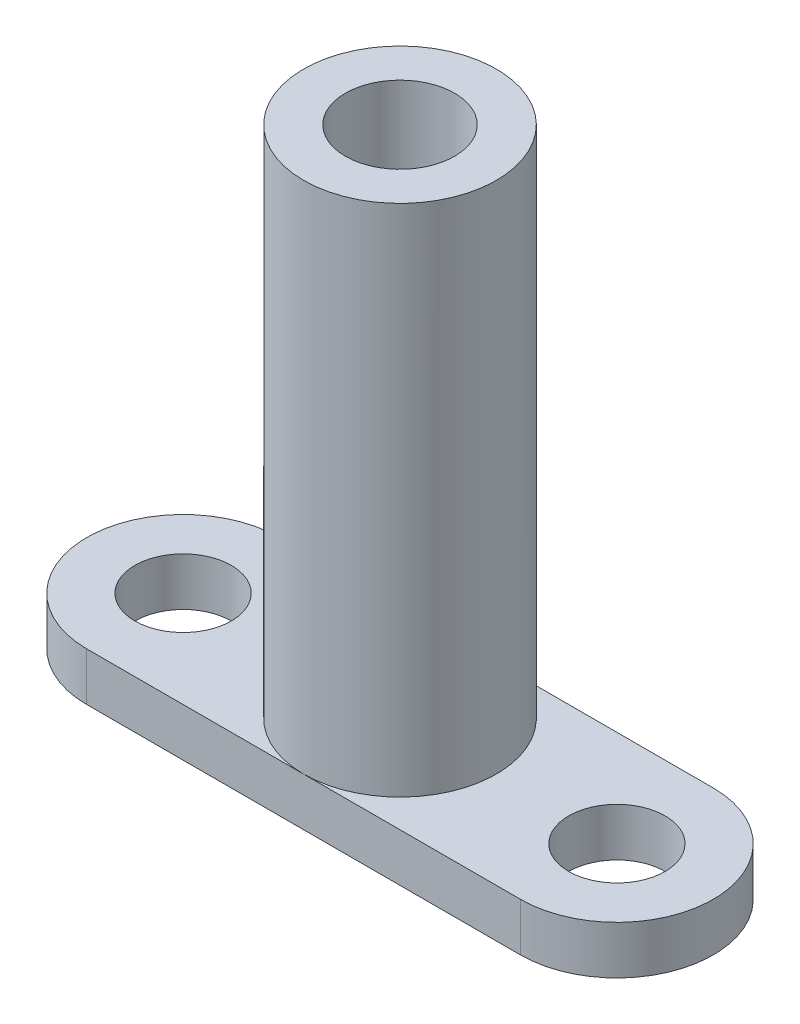
ISO-10303-21;
HEADER;
FILE_DESCRIPTION(('STEP AP214'),'2;1');
FILE_NAME('part.step','',(''),(''),'','','');
FILE_SCHEMA(('AUTOMOTIVE_DESIGN { 1 0 10303 214 1 1 1 1 }'));
ENDSEC;
DATA;
#1=APPLICATION_CONTEXT('core data for automotive mechanical design processes');
#2=APPLICATION_PROTOCOL_DEFINITION('international standard','automotive_design',2000,#1);
#3=PRODUCT_CONTEXT('',#1,'mechanical');
#4=PRODUCT('Part','Part','',(#3));
#5=PRODUCT_RELATED_PRODUCT_CATEGORY('part','',(#4));
#6=PRODUCT_DEFINITION_FORMATION('','',#4);
#7=PRODUCT_DEFINITION_CONTEXT('part definition',#1,'design');
#8=PRODUCT_DEFINITION('design','',#6,#7);
#9=PRODUCT_DEFINITION_SHAPE('','',#8);
#10=(LENGTH_UNIT() NAMED_UNIT(*) SI_UNIT(.MILLI.,.METRE.));
#11=(NAMED_UNIT(*) PLANE_ANGLE_UNIT() SI_UNIT($,.RADIAN.));
#12=(NAMED_UNIT(*) SI_UNIT($,.STERADIAN.) SOLID_ANGLE_UNIT());
#13=UNCERTAINTY_MEASURE_WITH_UNIT(LENGTH_MEASURE(1.E-05),#10,'distance_accuracy_value','');
#14=(GEOMETRIC_REPRESENTATION_CONTEXT(3) GLOBAL_UNCERTAINTY_ASSIGNED_CONTEXT((#13)) GLOBAL_UNIT_ASSIGNED_CONTEXT((#10,
#11,#12)) REPRESENTATION_CONTEXT('',''));
#15=CARTESIAN_POINT('',(0.,0.,0.));
#16=DIRECTION('',(0.,0.,1.));
#17=DIRECTION('',(1.,0.,0.));
#18=AXIS2_PLACEMENT_3D('',#15,#16,#17);
#19=CARTESIAN_POINT('',(0.,3.,0.));
#20=DIRECTION('',(0.,1.,0.));
#21=DIRECTION('',(0.,0.,1.));
#22=AXIS2_PLACEMENT_3D('',#19,#20,#21);
#23=PLANE('',#22);
#24=CARTESIAN_POINT('',(13.5,3.,0.));
#25=DIRECTION('',(0.,1.,0.));
#26=DIRECTION('',(0.,0.,1.));
#27=AXIS2_PLACEMENT_3D('',#24,#25,#26);
#28=CIRCLE('',#27,3.);
#29=CARTESIAN_POINT('',(13.5,3.,3.));
#30=VERTEX_POINT('',#29);
#31=EDGE_CURVE('E149',#30,#30,#28,.T.);
#32=ORIENTED_EDGE('',*,*,#31,.F.);
#33=EDGE_LOOP('',(#32));
#34=FACE_BOUND('',#33,.T.);
#35=CARTESIAN_POINT('',(0.,3.,0.));
#36=DIRECTION('',(0.,1.,0.));
#37=DIRECTION('',(0.,0.,1.));
#38=AXIS2_PLACEMENT_3D('',#35,#36,#37);
#39=CIRCLE('',#38,6.);
#40=CARTESIAN_POINT('',(0.,3.,6.));
#41=VERTEX_POINT('',#40);
#42=CARTESIAN_POINT('',(0.,3.,-6.));
#43=VERTEX_POINT('',#42);
#44=EDGE_CURVE('E50',#41,#43,#39,.T.);
#45=ORIENTED_EDGE('',*,*,#44,.F.);
#46=DIRECTION('',(1.,0.,0.));
#47=VECTOR('',#46,1.);
#48=CARTESIAN_POINT('',(0.,3.,6.));
#49=LINE('',#48,#47);
#50=CARTESIAN_POINT('',(13.5,3.,6.));
#51=VERTEX_POINT('',#50);
#52=EDGE_CURVE('E98',#41,#51,#49,.T.);
#53=ORIENTED_EDGE('',*,*,#52,.T.);
#54=CARTESIAN_POINT('',(13.5,3.,0.));
#55=DIRECTION('',(0.,1.,0.));
#56=DIRECTION('',(0.,0.,1.));
#57=AXIS2_PLACEMENT_3D('',#54,#55,#56);
#58=CIRCLE('',#57,6.);
#59=CARTESIAN_POINT('',(13.5,3.,-6.));
#60=VERTEX_POINT('',#59);
#61=EDGE_CURVE('E97',#51,#60,#58,.T.);
#62=ORIENTED_EDGE('',*,*,#61,.T.);
#63=DIRECTION('',(1.,0.,0.));
#64=VECTOR('',#63,1.);
#65=CARTESIAN_POINT('',(0.,3.,-6.));
#66=LINE('',#65,#64);
#67=EDGE_CURVE('E109',#43,#60,#66,.T.);
#68=ORIENTED_EDGE('',*,*,#67,.F.);
#69=EDGE_LOOP('',(#45,#53,#62,#68));
#70=FACE_BOUND('',#69,.T.);
#71=ADVANCED_FACE('F39',(#34,#70),#23,.T.);
#72=CARTESIAN_POINT('',(-13.5,3.,0.));
#73=DIRECTION('',(0.,-1.,0.));
#74=DIRECTION('',(0.,0.,-1.));
#75=AXIS2_PLACEMENT_3D('',#72,#73,#74);
#76=CYLINDRICAL_SURFACE('',#75,6.);
#77=CARTESIAN_POINT('',(-13.5,0.,0.));
#78=DIRECTION('',(0.,1.,0.));
#79=DIRECTION('',(0.,0.,1.));
#80=AXIS2_PLACEMENT_3D('',#77,#78,#79);
#81=CIRCLE('',#80,6.);
#82=CARTESIAN_POINT('',(-13.5,0.,-6.));
#83=VERTEX_POINT('',#82);
#84=CARTESIAN_POINT('',(-13.5,0.,6.));
#85=VERTEX_POINT('',#84);
#86=EDGE_CURVE('E161',#83,#85,#81,.T.);
#87=ORIENTED_EDGE('',*,*,#86,.T.);
#88=DIRECTION('',(0.,-1.,0.));
#89=VECTOR('',#88,1.);
#90=CARTESIAN_POINT('',(-13.5,3.,6.));
#91=LINE('',#90,#89);
#92=CARTESIAN_POINT('',(-13.5,3.,6.));
#93=VERTEX_POINT('',#92);
#94=EDGE_CURVE('E48',#93,#85,#91,.T.);
#95=ORIENTED_EDGE('',*,*,#94,.F.);
#96=CARTESIAN_POINT('',(-13.5,3.,0.));
#97=DIRECTION('',(0.,1.,0.));
#98=DIRECTION('',(0.,0.,1.));
#99=AXIS2_PLACEMENT_3D('',#96,#97,#98);
#100=CIRCLE('',#99,6.);
#101=CARTESIAN_POINT('',(-13.5,3.,-6.));
#102=VERTEX_POINT('',#101);
#103=EDGE_CURVE('E95',#102,#93,#100,.T.);
#104=ORIENTED_EDGE('',*,*,#103,.F.);
#105=DIRECTION('',(0.,-1.,0.));
#106=VECTOR('',#105,1.);
#107=CARTESIAN_POINT('',(-13.5,3.,-6.));
#108=LINE('',#107,#106);
#109=EDGE_CURVE('E64',#102,#83,#108,.T.);
#110=ORIENTED_EDGE('',*,*,#109,.T.);
#111=EDGE_LOOP('',(#87,#95,#104,#110));
#112=FACE_BOUND('',#111,.T.);
#113=ADVANCED_FACE('F41',(#112),#76,.T.);
#114=CARTESIAN_POINT('',(0.,3.,6.));
#115=DIRECTION('',(0.,0.,-1.));
#116=DIRECTION('',(-1.,0.,0.));
#117=AXIS2_PLACEMENT_3D('',#114,#115,#116);
#118=PLANE('',#117);
#119=DIRECTION('',(1.,0.,0.));
#120=VECTOR('',#119,1.);
#121=CARTESIAN_POINT('',(0.,0.,6.));
#122=LINE('',#121,#120);
#123=CARTESIAN_POINT('',(13.5,0.,6.));
#124=VERTEX_POINT('',#123);
#125=EDGE_CURVE('E169',#85,#124,#122,.T.);
#126=ORIENTED_EDGE('',*,*,#125,.T.);
#127=DIRECTION('',(0.,-1.,0.));
#128=VECTOR('',#127,1.);
#129=CARTESIAN_POINT('',(13.5,3.,6.));
#130=LINE('',#129,#128);
#131=EDGE_CURVE('E104',#51,#124,#130,.T.);
#132=ORIENTED_EDGE('',*,*,#131,.F.);
#133=ORIENTED_EDGE('',*,*,#52,.F.);
#134=EDGE_CURVE('E90',#93,#41,#49,.T.);
#135=ORIENTED_EDGE('',*,*,#134,.F.);
#136=ORIENTED_EDGE('',*,*,#94,.T.);
#137=EDGE_LOOP('',(#126,#132,#133,#135,#136));
#138=FACE_BOUND('',#137,.T.);
#139=ADVANCED_FACE('F102',(#138),#118,.F.);
#140=CARTESIAN_POINT('',(13.5,3.,0.));
#141=DIRECTION('',(0.,-1.,0.));
#142=DIRECTION('',(0.,0.,-1.));
#143=AXIS2_PLACEMENT_3D('',#140,#141,#142);
#144=CYLINDRICAL_SURFACE('',#143,6.);
#145=CARTESIAN_POINT('',(13.5,0.,0.));
#146=DIRECTION('',(0.,1.,0.));
#147=DIRECTION('',(0.,0.,1.));
#148=AXIS2_PLACEMENT_3D('',#145,#146,#147);
#149=CIRCLE('',#148,6.);
#150=CARTESIAN_POINT('',(13.5,0.,-6.));
#151=VERTEX_POINT('',#150);
#152=EDGE_CURVE('E171',#124,#151,#149,.T.);
#153=ORIENTED_EDGE('',*,*,#152,.T.);
#154=DIRECTION('',(0.,-1.,0.));
#155=VECTOR('',#154,1.);
#156=CARTESIAN_POINT('',(13.5,3.,-6.));
#157=LINE('',#156,#155);
#158=EDGE_CURVE('E177',#60,#151,#157,.T.);
#159=ORIENTED_EDGE('',*,*,#158,.F.);
#160=ORIENTED_EDGE('',*,*,#61,.F.);
#161=ORIENTED_EDGE('',*,*,#131,.T.);
#162=EDGE_LOOP('',(#153,#159,#160,#161));
#163=FACE_BOUND('',#162,.T.);
#164=ADVANCED_FACE('F142',(#163),#144,.T.);
#165=CARTESIAN_POINT('',(0.,3.,-6.));
#166=DIRECTION('',(0.,0.,-1.));
#167=DIRECTION('',(-1.,0.,0.));
#168=AXIS2_PLACEMENT_3D('',#165,#166,#167);
#169=PLANE('',#168);
#170=DIRECTION('',(1.,0.,0.));
#171=VECTOR('',#170,1.);
#172=CARTESIAN_POINT('',(0.,0.,-6.));
#173=LINE('',#172,#171);
#174=EDGE_CURVE('E163',#83,#151,#173,.T.);
#175=ORIENTED_EDGE('',*,*,#174,.F.);
#176=ORIENTED_EDGE('',*,*,#109,.F.);
#177=EDGE_CURVE('E166',#102,#43,#66,.T.);
#178=ORIENTED_EDGE('',*,*,#177,.T.);
#179=ORIENTED_EDGE('',*,*,#67,.T.);
#180=ORIENTED_EDGE('',*,*,#158,.T.);
#181=EDGE_LOOP('',(#175,#176,#178,#179,#180));
#182=FACE_BOUND('',#181,.T.);
#183=ADVANCED_FACE('F137',(#182),#169,.T.);
#184=CARTESIAN_POINT('',(-13.5,3.,0.));
#185=DIRECTION('',(0.,1.,0.));
#186=DIRECTION('',(0.,0.,1.));
#187=AXIS2_PLACEMENT_3D('',#184,#185,#186);
#188=CIRCLE('',#187,3.);
#189=CARTESIAN_POINT('',(-13.5,3.,3.));
#190=VERTEX_POINT('',#189);
#191=EDGE_CURVE('E146',#190,#190,#188,.T.);
#192=ORIENTED_EDGE('',*,*,#191,.F.);
#193=EDGE_LOOP('',(#192));
#194=FACE_BOUND('',#193,.T.);
#195=EDGE_CURVE('E11',#43,#41,#39,.T.);
#196=ORIENTED_EDGE('',*,*,#195,.F.);
#197=ORIENTED_EDGE('',*,*,#177,.F.);
#198=ORIENTED_EDGE('',*,*,#103,.T.);
#199=ORIENTED_EDGE('',*,*,#134,.T.);
#200=EDGE_LOOP('',(#196,#197,#198,#199));
#201=FACE_BOUND('',#200,.T.);
#202=ADVANCED_FACE('F94',(#194,#201),#23,.T.);
#203=CARTESIAN_POINT('',(0.,0.,0.));
#204=DIRECTION('',(0.,1.,0.));
#205=DIRECTION('',(0.,0.,1.));
#206=AXIS2_PLACEMENT_3D('',#203,#204,#205);
#207=PLANE('',#206);
#208=CARTESIAN_POINT('',(-13.5,0.,0.));
#209=DIRECTION('',(0.,1.,0.));
#210=DIRECTION('',(0.,0.,1.));
#211=AXIS2_PLACEMENT_3D('',#208,#209,#210);
#212=CIRCLE('',#211,3.);
#213=CARTESIAN_POINT('',(-13.5,0.,3.));
#214=VERTEX_POINT('',#213);
#215=EDGE_CURVE('E43',#214,#214,#212,.T.);
#216=ORIENTED_EDGE('',*,*,#215,.T.);
#217=EDGE_LOOP('',(#216));
#218=FACE_BOUND('',#217,.T.);
#219=CARTESIAN_POINT('',(13.5,0.,0.));
#220=DIRECTION('',(0.,1.,0.));
#221=DIRECTION('',(0.,0.,1.));
#222=AXIS2_PLACEMENT_3D('',#219,#220,#221);
#223=CIRCLE('',#222,3.);
#224=CARTESIAN_POINT('',(13.5,0.,3.));
#225=VERTEX_POINT('',#224);
#226=EDGE_CURVE('E148',#225,#225,#223,.T.);
#227=ORIENTED_EDGE('',*,*,#226,.T.);
#228=EDGE_LOOP('',(#227));
#229=FACE_BOUND('',#228,.T.);
#230=CARTESIAN_POINT('',(0.,0.,0.));
#231=DIRECTION('',(0.,1.,0.));
#232=DIRECTION('',(0.,0.,1.));
#233=AXIS2_PLACEMENT_3D('',#230,#231,#232);
#234=CIRCLE('',#233,3.39999999999999);
#235=CARTESIAN_POINT('',(0.,0.,3.39999999999999));
#236=VERTEX_POINT('',#235);
#237=EDGE_CURVE('E112',#236,#236,#234,.T.);
#238=ORIENTED_EDGE('',*,*,#237,.T.);
#239=EDGE_LOOP('',(#238));
#240=FACE_BOUND('',#239,.T.);
#241=ORIENTED_EDGE('',*,*,#86,.F.);
#242=ORIENTED_EDGE('',*,*,#174,.T.);
#243=ORIENTED_EDGE('',*,*,#152,.F.);
#244=ORIENTED_EDGE('',*,*,#125,.F.);
#245=EDGE_LOOP('',(#241,#242,#243,#244));
#246=FACE_BOUND('',#245,.T.);
#247=ADVANCED_FACE('F116',(#218,#229,#240,#246),#207,.F.);
#248=CARTESIAN_POINT('',(0.,35.,0.));
#249=DIRECTION('',(0.,-1.,0.));
#250=DIRECTION('',(0.,0.,-1.));
#251=AXIS2_PLACEMENT_3D('',#248,#249,#250);
#252=CYLINDRICAL_SURFACE('',#251,6.);
#253=CARTESIAN_POINT('',(0.,35.,0.));
#254=DIRECTION('',(0.,1.,0.));
#255=DIRECTION('',(0.,0.,1.));
#256=AXIS2_PLACEMENT_3D('',#253,#254,#255);
#257=CIRCLE('',#256,6.);
#258=CARTESIAN_POINT('',(0.,35.,6.));
#259=VERTEX_POINT('',#258);
#260=EDGE_CURVE('E111',#259,#259,#257,.T.);
#261=ORIENTED_EDGE('',*,*,#260,.F.);
#262=EDGE_LOOP('',(#261));
#263=FACE_BOUND('',#262,.T.);
#264=ORIENTED_EDGE('',*,*,#44,.T.);
#265=ORIENTED_EDGE('',*,*,#195,.T.);
#266=EDGE_LOOP('',(#264,#265));
#267=FACE_BOUND('',#266,.T.);
#268=ADVANCED_FACE('F113',(#263,#267),#252,.T.);
#269=CARTESIAN_POINT('',(0.,35.,0.));
#270=DIRECTION('',(0.,1.,0.));
#271=DIRECTION('',(0.,0.,1.));
#272=AXIS2_PLACEMENT_3D('',#269,#270,#271);
#273=PLANE('',#272);
#274=CARTESIAN_POINT('',(0.,35.,0.));
#275=DIRECTION('',(0.,1.,0.));
#276=DIRECTION('',(0.,0.,1.));
#277=AXIS2_PLACEMENT_3D('',#274,#275,#276);
#278=CIRCLE('',#277,3.4);
#279=CARTESIAN_POINT('',(0.,35.,3.4));
#280=VERTEX_POINT('',#279);
#281=EDGE_CURVE('E155',#280,#280,#278,.T.);
#282=ORIENTED_EDGE('',*,*,#281,.F.);
#283=EDGE_LOOP('',(#282));
#284=FACE_BOUND('',#283,.T.);
#285=ORIENTED_EDGE('',*,*,#260,.T.);
#286=EDGE_LOOP('',(#285));
#287=FACE_BOUND('',#286,.T.);
#288=ADVANCED_FACE('F115',(#284,#287),#273,.T.);
#289=CARTESIAN_POINT('',(0.,35.,0.));
#290=DIRECTION('',(0.,1.,0.));
#291=DIRECTION('',(0.,0.,1.));
#292=AXIS2_PLACEMENT_3D('',#289,#290,#291);
#293=CYLINDRICAL_SURFACE('',#292,3.39999999999999);
#294=ORIENTED_EDGE('',*,*,#237,.F.);
#295=EDGE_LOOP('',(#294));
#296=FACE_BOUND('',#295,.T.);
#297=ORIENTED_EDGE('',*,*,#281,.T.);
#298=EDGE_LOOP('',(#297));
#299=FACE_BOUND('',#298,.T.);
#300=ADVANCED_FACE('F123',(#296,#299),#293,.F.);
#301=CARTESIAN_POINT('',(13.5,-7.,0.));
#302=DIRECTION('',(0.,1.,0.));
#303=DIRECTION('',(0.,0.,1.));
#304=AXIS2_PLACEMENT_3D('',#301,#302,#303);
#305=CYLINDRICAL_SURFACE('',#304,3.);
#306=ORIENTED_EDGE('',*,*,#31,.T.);
#307=EDGE_LOOP('',(#306));
#308=FACE_BOUND('',#307,.T.);
#309=ORIENTED_EDGE('',*,*,#226,.F.);
#310=EDGE_LOOP('',(#309));
#311=FACE_BOUND('',#310,.T.);
#312=ADVANCED_FACE('F258',(#308,#311),#305,.F.);
#313=CARTESIAN_POINT('',(-13.5,-7.,0.));
#314=DIRECTION('',(0.,1.,0.));
#315=DIRECTION('',(0.,0.,1.));
#316=AXIS2_PLACEMENT_3D('',#313,#314,#315);
#317=CYLINDRICAL_SURFACE('',#316,3.);
#318=ORIENTED_EDGE('',*,*,#191,.T.);
#319=EDGE_LOOP('',(#318));
#320=FACE_BOUND('',#319,.T.);
#321=ORIENTED_EDGE('',*,*,#215,.F.);
#322=EDGE_LOOP('',(#321));
#323=FACE_BOUND('',#322,.T.);
#324=ADVANCED_FACE('F267',(#320,#323),#317,.F.);
#325=CLOSED_SHELL('',(#71,#113,#139,#164,#183,#202,#247,#268,#288,#300,#312,#324));
#326=MANIFOLD_SOLID_BREP('B2',#325);
#327=ADVANCED_BREP_SHAPE_REPRESENTATION('',(#18,#326),#14);
#328=SHAPE_DEFINITION_REPRESENTATION(#9,#327);
ENDSEC;
END-ISO-10303-21;
